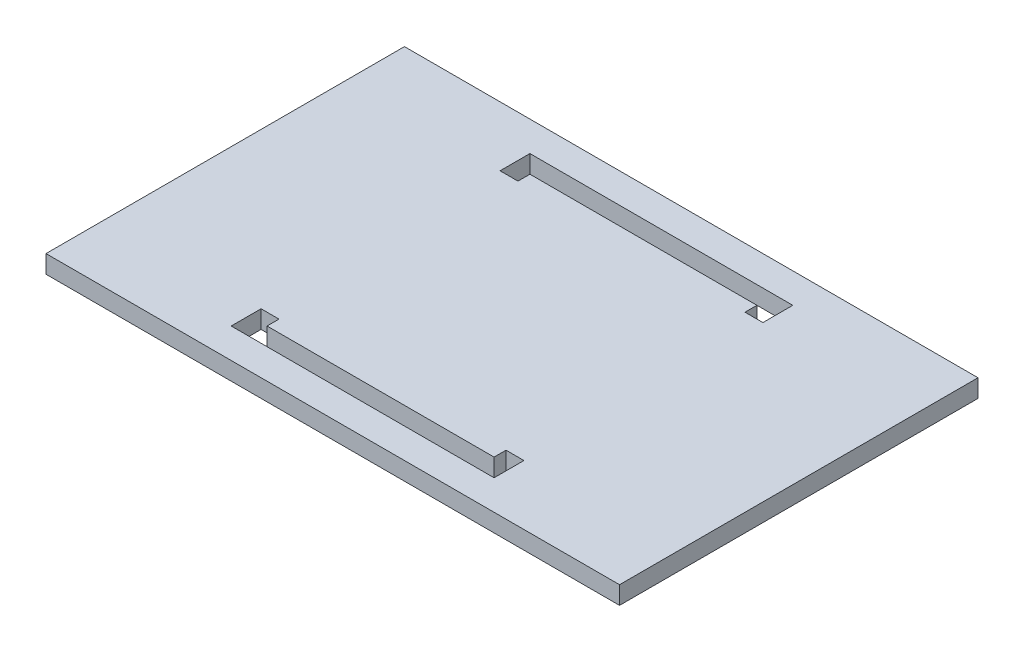
ISO-10303-21;
HEADER;
FILE_DESCRIPTION(('STEP AP214'),'2;1');
FILE_NAME('part.step','',(''),(''),'','','');
FILE_SCHEMA(('AUTOMOTIVE_DESIGN { 1 0 10303 214 1 1 1 1 }'));
ENDSEC;
DATA;
#1=APPLICATION_CONTEXT('core data for automotive mechanical design processes');
#2=APPLICATION_PROTOCOL_DEFINITION('international standard','automotive_design',2000,#1);
#3=PRODUCT_CONTEXT('',#1,'mechanical');
#4=PRODUCT('Part','Part','',(#3));
#5=PRODUCT_RELATED_PRODUCT_CATEGORY('part','',(#4));
#6=PRODUCT_DEFINITION_FORMATION('','',#4);
#7=PRODUCT_DEFINITION_CONTEXT('part definition',#1,'design');
#8=PRODUCT_DEFINITION('design','',#6,#7);
#9=PRODUCT_DEFINITION_SHAPE('','',#8);
#10=(LENGTH_UNIT() NAMED_UNIT(*) SI_UNIT(.MILLI.,.METRE.));
#11=(NAMED_UNIT(*) PLANE_ANGLE_UNIT() SI_UNIT($,.RADIAN.));
#12=(NAMED_UNIT(*) SI_UNIT($,.STERADIAN.) SOLID_ANGLE_UNIT());
#13=UNCERTAINTY_MEASURE_WITH_UNIT(LENGTH_MEASURE(1.E-05),#10,'distance_accuracy_value','');
#14=(GEOMETRIC_REPRESENTATION_CONTEXT(3) GLOBAL_UNCERTAINTY_ASSIGNED_CONTEXT((#13)) GLOBAL_UNIT_ASSIGNED_CONTEXT((#10,
#11,#12)) REPRESENTATION_CONTEXT('',''));
#15=CARTESIAN_POINT('',(0.,0.,0.));
#16=DIRECTION('',(0.,0.,1.));
#17=DIRECTION('',(1.,0.,0.));
#18=AXIS2_PLACEMENT_3D('',#15,#16,#17);
#19=CARTESIAN_POINT('',(0.,3.,25.));
#20=DIRECTION('',(0.,0.,-1.));
#21=DIRECTION('',(-1.,0.,0.));
#22=AXIS2_PLACEMENT_3D('',#19,#20,#21);
#23=PLANE('',#22);
#24=DIRECTION('',(1.,0.,0.));
#25=VECTOR('',#24,1.);
#26=CARTESIAN_POINT('',(0.,0.,25.));
#27=LINE('',#26,#25);
#28=CARTESIAN_POINT('',(-22.,0.,25.));
#29=VERTEX_POINT('',#28);
#30=CARTESIAN_POINT('',(22.,0.,25.));
#31=VERTEX_POINT('',#30);
#32=EDGE_CURVE('E244',#29,#31,#27,.T.);
#33=ORIENTED_EDGE('',*,*,#32,.F.);
#34=DIRECTION('',(0.,-1.,0.));
#35=VECTOR('',#34,1.);
#36=CARTESIAN_POINT('',(-22.,3.,25.));
#37=LINE('',#36,#35);
#38=CARTESIAN_POINT('',(-22.,3.,25.));
#39=VERTEX_POINT('',#38);
#40=EDGE_CURVE('E11',#39,#29,#37,.T.);
#41=ORIENTED_EDGE('',*,*,#40,.F.);
#42=DIRECTION('',(1.,0.,0.));
#43=VECTOR('',#42,1.);
#44=CARTESIAN_POINT('',(0.,3.,25.));
#45=LINE('',#44,#43);
#46=CARTESIAN_POINT('',(22.,3.,25.));
#47=VERTEX_POINT('',#46);
#48=EDGE_CURVE('E342',#39,#47,#45,.T.);
#49=ORIENTED_EDGE('',*,*,#48,.T.);
#50=DIRECTION('',(0.,-1.,0.));
#51=VECTOR('',#50,1.);
#52=CARTESIAN_POINT('',(22.,3.,25.));
#53=LINE('',#52,#51);
#54=EDGE_CURVE('E54',#47,#31,#53,.T.);
#55=ORIENTED_EDGE('',*,*,#54,.T.);
#56=EDGE_LOOP('',(#33,#41,#49,#55));
#57=FACE_BOUND('',#56,.T.);
#58=ADVANCED_FACE('F35',(#57),#23,.T.);
#59=CARTESIAN_POINT('',(-22.,3.,0.));
#60=DIRECTION('',(1.,0.,0.));
#61=DIRECTION('',(0.,0.,-1.));
#62=AXIS2_PLACEMENT_3D('',#59,#60,#61);
#63=PLANE('',#62);
#64=DIRECTION('',(0.,0.,1.));
#65=VECTOR('',#64,1.);
#66=CARTESIAN_POINT('',(-22.,0.,0.));
#67=LINE('',#66,#65);
#68=CARTESIAN_POINT('',(-22.,0.,20.));
#69=VERTEX_POINT('',#68);
#70=EDGE_CURVE('E246',#69,#29,#67,.T.);
#71=ORIENTED_EDGE('',*,*,#70,.F.);
#72=DIRECTION('',(0.,-1.,0.));
#73=VECTOR('',#72,1.);
#74=CARTESIAN_POINT('',(-22.,3.,20.));
#75=LINE('',#74,#73);
#76=CARTESIAN_POINT('',(-22.,3.,20.));
#77=VERTEX_POINT('',#76);
#78=EDGE_CURVE('E45',#77,#69,#75,.T.);
#79=ORIENTED_EDGE('',*,*,#78,.F.);
#80=DIRECTION('',(0.,0.,1.));
#81=VECTOR('',#80,1.);
#82=CARTESIAN_POINT('',(-22.,3.,0.));
#83=LINE('',#82,#81);
#84=EDGE_CURVE('E344',#77,#39,#83,.T.);
#85=ORIENTED_EDGE('',*,*,#84,.T.);
#86=ORIENTED_EDGE('',*,*,#40,.T.);
#87=EDGE_LOOP('',(#71,#79,#85,#86));
#88=FACE_BOUND('',#87,.T.);
#89=ADVANCED_FACE('F370',(#88),#63,.T.);
#90=CARTESIAN_POINT('',(0.,3.,20.));
#91=DIRECTION('',(0.,0.,1.));
#92=DIRECTION('',(1.,0.,0.));
#93=AXIS2_PLACEMENT_3D('',#90,#91,#92);
#94=PLANE('',#93);
#95=DIRECTION('',(-1.,0.,0.));
#96=VECTOR('',#95,1.);
#97=CARTESIAN_POINT('',(0.,0.,20.));
#98=LINE('',#97,#96);
#99=CARTESIAN_POINT('',(-19.,0.,20.));
#100=VERTEX_POINT('',#99);
#101=EDGE_CURVE('E249',#100,#69,#98,.T.);
#102=ORIENTED_EDGE('',*,*,#101,.F.);
#103=DIRECTION('',(0.,-1.,0.));
#104=VECTOR('',#103,1.);
#105=CARTESIAN_POINT('',(-19.,3.,20.));
#106=LINE('',#105,#104);
#107=CARTESIAN_POINT('',(-19.,3.,20.));
#108=VERTEX_POINT('',#107);
#109=EDGE_CURVE('E271',#108,#100,#106,.T.);
#110=ORIENTED_EDGE('',*,*,#109,.F.);
#111=DIRECTION('',(-1.,0.,0.));
#112=VECTOR('',#111,1.);
#113=CARTESIAN_POINT('',(0.,3.,20.));
#114=LINE('',#113,#112);
#115=EDGE_CURVE('E347',#108,#77,#114,.T.);
#116=ORIENTED_EDGE('',*,*,#115,.T.);
#117=ORIENTED_EDGE('',*,*,#78,.T.);
#118=EDGE_LOOP('',(#102,#110,#116,#117));
#119=FACE_BOUND('',#118,.T.);
#120=ADVANCED_FACE('F375',(#119),#94,.T.);
#121=CARTESIAN_POINT('',(-19.,3.,0.));
#122=DIRECTION('',(-1.,0.,0.));
#123=DIRECTION('',(0.,0.,1.));
#124=AXIS2_PLACEMENT_3D('',#121,#122,#123);
#125=PLANE('',#124);
#126=DIRECTION('',(0.,0.,-1.));
#127=VECTOR('',#126,1.);
#128=CARTESIAN_POINT('',(-19.,0.,0.));
#129=LINE('',#128,#127);
#130=CARTESIAN_POINT('',(-19.,0.,22.));
#131=VERTEX_POINT('',#130);
#132=EDGE_CURVE('E252',#131,#100,#129,.T.);
#133=ORIENTED_EDGE('',*,*,#132,.F.);
#134=DIRECTION('',(0.,-1.,0.));
#135=VECTOR('',#134,1.);
#136=CARTESIAN_POINT('',(-19.,3.,22.));
#137=LINE('',#136,#135);
#138=CARTESIAN_POINT('',(-19.,3.,22.));
#139=VERTEX_POINT('',#138);
#140=EDGE_CURVE('E269',#139,#131,#137,.T.);
#141=ORIENTED_EDGE('',*,*,#140,.F.);
#142=DIRECTION('',(0.,0.,-1.));
#143=VECTOR('',#142,1.);
#144=CARTESIAN_POINT('',(-19.,3.,0.));
#145=LINE('',#144,#143);
#146=EDGE_CURVE('E350',#139,#108,#145,.T.);
#147=ORIENTED_EDGE('',*,*,#146,.T.);
#148=ORIENTED_EDGE('',*,*,#109,.T.);
#149=EDGE_LOOP('',(#133,#141,#147,#148));
#150=FACE_BOUND('',#149,.T.);
#151=ADVANCED_FACE('F463',(#150),#125,.T.);
#152=CARTESIAN_POINT('',(0.,3.,22.));
#153=DIRECTION('',(0.,0.,1.));
#154=DIRECTION('',(1.,0.,0.));
#155=AXIS2_PLACEMENT_3D('',#152,#153,#154);
#156=PLANE('',#155);
#157=DIRECTION('',(-1.,0.,0.));
#158=VECTOR('',#157,1.);
#159=CARTESIAN_POINT('',(0.,0.,22.));
#160=LINE('',#159,#158);
#161=CARTESIAN_POINT('',(19.,0.,22.));
#162=VERTEX_POINT('',#161);
#163=EDGE_CURVE('E255',#162,#131,#160,.T.);
#164=ORIENTED_EDGE('',*,*,#163,.F.);
#165=DIRECTION('',(0.,-1.,0.));
#166=VECTOR('',#165,1.);
#167=CARTESIAN_POINT('',(19.,3.,22.));
#168=LINE('',#167,#166);
#169=CARTESIAN_POINT('',(19.,3.,22.));
#170=VERTEX_POINT('',#169);
#171=EDGE_CURVE('E188',#170,#162,#168,.T.);
#172=ORIENTED_EDGE('',*,*,#171,.F.);
#173=DIRECTION('',(-1.,0.,0.));
#174=VECTOR('',#173,1.);
#175=CARTESIAN_POINT('',(0.,3.,22.));
#176=LINE('',#175,#174);
#177=EDGE_CURVE('E199',#170,#139,#176,.T.);
#178=ORIENTED_EDGE('',*,*,#177,.T.);
#179=ORIENTED_EDGE('',*,*,#140,.T.);
#180=EDGE_LOOP('',(#164,#172,#178,#179));
#181=FACE_BOUND('',#180,.T.);
#182=ADVANCED_FACE('F354',(#181),#156,.T.);
#183=CARTESIAN_POINT('',(19.,3.,0.));
#184=DIRECTION('',(1.,0.,0.));
#185=DIRECTION('',(0.,0.,-1.));
#186=AXIS2_PLACEMENT_3D('',#183,#184,#185);
#187=PLANE('',#186);
#188=DIRECTION('',(0.,0.,1.));
#189=VECTOR('',#188,1.);
#190=CARTESIAN_POINT('',(19.,0.,0.));
#191=LINE('',#190,#189);
#192=CARTESIAN_POINT('',(19.,0.,20.));
#193=VERTEX_POINT('',#192);
#194=EDGE_CURVE('E184',#193,#162,#191,.T.);
#195=ORIENTED_EDGE('',*,*,#194,.F.);
#196=DIRECTION('',(0.,-1.,0.));
#197=VECTOR('',#196,1.);
#198=CARTESIAN_POINT('',(19.,3.,20.));
#199=LINE('',#198,#197);
#200=CARTESIAN_POINT('',(19.,3.,20.));
#201=VERTEX_POINT('',#200);
#202=EDGE_CURVE('E179',#201,#193,#199,.T.);
#203=ORIENTED_EDGE('',*,*,#202,.F.);
#204=DIRECTION('',(0.,0.,1.));
#205=VECTOR('',#204,1.);
#206=CARTESIAN_POINT('',(19.,3.,0.));
#207=LINE('',#206,#205);
#208=EDGE_CURVE('E182',#201,#170,#207,.T.);
#209=ORIENTED_EDGE('',*,*,#208,.T.);
#210=ORIENTED_EDGE('',*,*,#171,.T.);
#211=EDGE_LOOP('',(#195,#203,#209,#210));
#212=FACE_BOUND('',#211,.T.);
#213=ADVANCED_FACE('F181',(#212),#187,.T.);
#214=CARTESIAN_POINT('',(0.,3.,20.));
#215=DIRECTION('',(0.,0.,1.));
#216=DIRECTION('',(1.,0.,0.));
#217=AXIS2_PLACEMENT_3D('',#214,#215,#216);
#218=PLANE('',#217);
#219=DIRECTION('',(-1.,0.,0.));
#220=VECTOR('',#219,1.);
#221=CARTESIAN_POINT('',(0.,0.,20.));
#222=LINE('',#221,#220);
#223=CARTESIAN_POINT('',(22.,0.,20.));
#224=VERTEX_POINT('',#223);
#225=EDGE_CURVE('E259',#224,#193,#222,.T.);
#226=ORIENTED_EDGE('',*,*,#225,.F.);
#227=DIRECTION('',(0.,-1.,0.));
#228=VECTOR('',#227,1.);
#229=CARTESIAN_POINT('',(22.,3.,20.));
#230=LINE('',#229,#228);
#231=CARTESIAN_POINT('',(22.,3.,20.));
#232=VERTEX_POINT('',#231);
#233=EDGE_CURVE('E115',#232,#224,#230,.T.);
#234=ORIENTED_EDGE('',*,*,#233,.F.);
#235=DIRECTION('',(-1.,0.,0.));
#236=VECTOR('',#235,1.);
#237=CARTESIAN_POINT('',(0.,3.,20.));
#238=LINE('',#237,#236);
#239=EDGE_CURVE('E196',#232,#201,#238,.T.);
#240=ORIENTED_EDGE('',*,*,#239,.T.);
#241=ORIENTED_EDGE('',*,*,#202,.T.);
#242=EDGE_LOOP('',(#226,#234,#240,#241));
#243=FACE_BOUND('',#242,.T.);
#244=ADVANCED_FACE('F201',(#243),#218,.T.);
#245=CARTESIAN_POINT('',(-22.,3.,0.));
#246=DIRECTION('',(1.,0.,0.));
#247=DIRECTION('',(0.,0.,-1.));
#248=AXIS2_PLACEMENT_3D('',#245,#246,#247);
#249=PLANE('',#248);
#250=DIRECTION('',(0.,0.,1.));
#251=VECTOR('',#250,1.);
#252=CARTESIAN_POINT('',(-22.,0.,0.));
#253=LINE('',#252,#251);
#254=CARTESIAN_POINT('',(-22.,0.,-24.9999999999999));
#255=VERTEX_POINT('',#254);
#256=CARTESIAN_POINT('',(-22.,0.,-20.));
#257=VERTEX_POINT('',#256);
#258=EDGE_CURVE('E220',#255,#257,#253,.T.);
#259=ORIENTED_EDGE('',*,*,#258,.F.);
#260=DIRECTION('',(0.,-1.,0.));
#261=VECTOR('',#260,1.);
#262=CARTESIAN_POINT('',(-22.,3.,-24.9999999999999));
#263=LINE('',#262,#261);
#264=CARTESIAN_POINT('',(-22.,3.,-24.9999999999999));
#265=VERTEX_POINT('',#264);
#266=EDGE_CURVE('E266',#265,#255,#263,.T.);
#267=ORIENTED_EDGE('',*,*,#266,.F.);
#268=DIRECTION('',(0.,0.,1.));
#269=VECTOR('',#268,1.);
#270=CARTESIAN_POINT('',(-22.,3.,0.));
#271=LINE('',#270,#269);
#272=CARTESIAN_POINT('',(-22.,3.,-20.));
#273=VERTEX_POINT('',#272);
#274=EDGE_CURVE('E316',#265,#273,#271,.T.);
#275=ORIENTED_EDGE('',*,*,#274,.T.);
#276=DIRECTION('',(0.,-1.,0.));
#277=VECTOR('',#276,1.);
#278=CARTESIAN_POINT('',(-22.,3.,-20.));
#279=LINE('',#278,#277);
#280=EDGE_CURVE('E274',#273,#257,#279,.T.);
#281=ORIENTED_EDGE('',*,*,#280,.T.);
#282=EDGE_LOOP('',(#259,#267,#275,#281));
#283=FACE_BOUND('',#282,.T.);
#284=ADVANCED_FACE('F406',(#283),#249,.T.);
#285=CARTESIAN_POINT('',(0.,3.,-24.9999999999999));
#286=DIRECTION('',(0.,0.,-1.));
#287=DIRECTION('',(-1.,0.,0.));
#288=AXIS2_PLACEMENT_3D('',#285,#286,#287);
#289=PLANE('',#288);
#290=DIRECTION('',(1.,0.,0.));
#291=VECTOR('',#290,1.);
#292=CARTESIAN_POINT('',(0.,0.,-24.9999999999999));
#293=LINE('',#292,#291);
#294=CARTESIAN_POINT('',(22.,0.,-24.9999999999999));
#295=VERTEX_POINT('',#294);
#296=EDGE_CURVE('E223',#255,#295,#293,.T.);
#297=ORIENTED_EDGE('',*,*,#296,.T.);
#298=DIRECTION('',(0.,-1.,0.));
#299=VECTOR('',#298,1.);
#300=CARTESIAN_POINT('',(22.,3.,-24.9999999999999));
#301=LINE('',#300,#299);
#302=CARTESIAN_POINT('',(22.,3.,-24.9999999999999));
#303=VERTEX_POINT('',#302);
#304=EDGE_CURVE('E286',#303,#295,#301,.T.);
#305=ORIENTED_EDGE('',*,*,#304,.F.);
#306=DIRECTION('',(1.,0.,0.));
#307=VECTOR('',#306,1.);
#308=CARTESIAN_POINT('',(0.,3.,-24.9999999999999));
#309=LINE('',#308,#307);
#310=EDGE_CURVE('E319',#265,#303,#309,.T.);
#311=ORIENTED_EDGE('',*,*,#310,.F.);
#312=ORIENTED_EDGE('',*,*,#266,.T.);
#313=EDGE_LOOP('',(#297,#305,#311,#312));
#314=FACE_BOUND('',#313,.T.);
#315=ADVANCED_FACE('F402',(#314),#289,.F.);
#316=CARTESIAN_POINT('',(22.,3.,0.));
#317=DIRECTION('',(-1.,0.,0.));
#318=DIRECTION('',(0.,0.,1.));
#319=AXIS2_PLACEMENT_3D('',#316,#317,#318);
#320=PLANE('',#319);
#321=DIRECTION('',(0.,0.,-1.));
#322=VECTOR('',#321,1.);
#323=CARTESIAN_POINT('',(22.,0.,0.));
#324=LINE('',#323,#322);
#325=CARTESIAN_POINT('',(22.,0.,-20.));
#326=VERTEX_POINT('',#325);
#327=EDGE_CURVE('E226',#326,#295,#324,.T.);
#328=ORIENTED_EDGE('',*,*,#327,.F.);
#329=DIRECTION('',(0.,-1.,0.));
#330=VECTOR('',#329,1.);
#331=CARTESIAN_POINT('',(22.,3.,-20.));
#332=LINE('',#331,#330);
#333=CARTESIAN_POINT('',(22.,3.,-20.));
#334=VERTEX_POINT('',#333);
#335=EDGE_CURVE('E284',#334,#326,#332,.T.);
#336=ORIENTED_EDGE('',*,*,#335,.F.);
#337=DIRECTION('',(0.,0.,-1.));
#338=VECTOR('',#337,1.);
#339=CARTESIAN_POINT('',(22.,3.,0.));
#340=LINE('',#339,#338);
#341=EDGE_CURVE('E324',#334,#303,#340,.T.);
#342=ORIENTED_EDGE('',*,*,#341,.T.);
#343=ORIENTED_EDGE('',*,*,#304,.T.);
#344=EDGE_LOOP('',(#328,#336,#342,#343));
#345=FACE_BOUND('',#344,.T.);
#346=ADVANCED_FACE('F398',(#345),#320,.T.);
#347=CARTESIAN_POINT('',(0.,3.,-20.));
#348=DIRECTION('',(0.,0.,-1.));
#349=DIRECTION('',(-1.,0.,0.));
#350=AXIS2_PLACEMENT_3D('',#347,#348,#349);
#351=PLANE('',#350);
#352=DIRECTION('',(1.,0.,0.));
#353=VECTOR('',#352,1.);
#354=CARTESIAN_POINT('',(0.,0.,-20.));
#355=LINE('',#354,#353);
#356=CARTESIAN_POINT('',(19.,0.,-20.));
#357=VERTEX_POINT('',#356);
#358=EDGE_CURVE('E229',#357,#326,#355,.T.);
#359=ORIENTED_EDGE('',*,*,#358,.F.);
#360=DIRECTION('',(0.,-1.,0.));
#361=VECTOR('',#360,1.);
#362=CARTESIAN_POINT('',(19.,3.,-20.));
#363=LINE('',#362,#361);
#364=CARTESIAN_POINT('',(19.,3.,-20.));
#365=VERTEX_POINT('',#364);
#366=EDGE_CURVE('E282',#365,#357,#363,.T.);
#367=ORIENTED_EDGE('',*,*,#366,.F.);
#368=DIRECTION('',(1.,0.,0.));
#369=VECTOR('',#368,1.);
#370=CARTESIAN_POINT('',(0.,3.,-20.));
#371=LINE('',#370,#369);
#372=EDGE_CURVE('E327',#365,#334,#371,.T.);
#373=ORIENTED_EDGE('',*,*,#372,.T.);
#374=ORIENTED_EDGE('',*,*,#335,.T.);
#375=EDGE_LOOP('',(#359,#367,#373,#374));
#376=FACE_BOUND('',#375,.T.);
#377=ADVANCED_FACE('F394',(#376),#351,.T.);
#378=CARTESIAN_POINT('',(19.,3.,0.));
#379=DIRECTION('',(1.,0.,0.));
#380=DIRECTION('',(0.,0.,-1.));
#381=AXIS2_PLACEMENT_3D('',#378,#379,#380);
#382=PLANE('',#381);
#383=DIRECTION('',(0.,0.,1.));
#384=VECTOR('',#383,1.);
#385=CARTESIAN_POINT('',(19.,0.,0.));
#386=LINE('',#385,#384);
#387=CARTESIAN_POINT('',(19.,0.,-22.));
#388=VERTEX_POINT('',#387);
#389=EDGE_CURVE('E232',#388,#357,#386,.T.);
#390=ORIENTED_EDGE('',*,*,#389,.F.);
#391=DIRECTION('',(0.,-1.,0.));
#392=VECTOR('',#391,1.);
#393=CARTESIAN_POINT('',(19.,3.,-22.));
#394=LINE('',#393,#392);
#395=CARTESIAN_POINT('',(19.,3.,-22.));
#396=VERTEX_POINT('',#395);
#397=EDGE_CURVE('E280',#396,#388,#394,.T.);
#398=ORIENTED_EDGE('',*,*,#397,.F.);
#399=DIRECTION('',(0.,0.,1.));
#400=VECTOR('',#399,1.);
#401=CARTESIAN_POINT('',(19.,3.,0.));
#402=LINE('',#401,#400);
#403=EDGE_CURVE('E330',#396,#365,#402,.T.);
#404=ORIENTED_EDGE('',*,*,#403,.T.);
#405=ORIENTED_EDGE('',*,*,#366,.T.);
#406=EDGE_LOOP('',(#390,#398,#404,#405));
#407=FACE_BOUND('',#406,.T.);
#408=ADVANCED_FACE('F390',(#407),#382,.T.);
#409=CARTESIAN_POINT('',(0.,3.,-22.));
#410=DIRECTION('',(0.,0.,-1.));
#411=DIRECTION('',(-1.,0.,0.));
#412=AXIS2_PLACEMENT_3D('',#409,#410,#411);
#413=PLANE('',#412);
#414=DIRECTION('',(1.,0.,0.));
#415=VECTOR('',#414,1.);
#416=CARTESIAN_POINT('',(0.,0.,-22.));
#417=LINE('',#416,#415);
#418=CARTESIAN_POINT('',(-19.,0.,-22.));
#419=VERTEX_POINT('',#418);
#420=EDGE_CURVE('E235',#419,#388,#417,.T.);
#421=ORIENTED_EDGE('',*,*,#420,.F.);
#422=DIRECTION('',(0.,-1.,0.));
#423=VECTOR('',#422,1.);
#424=CARTESIAN_POINT('',(-19.,3.,-22.));
#425=LINE('',#424,#423);
#426=CARTESIAN_POINT('',(-19.,3.,-22.));
#427=VERTEX_POINT('',#426);
#428=EDGE_CURVE('E278',#427,#419,#425,.T.);
#429=ORIENTED_EDGE('',*,*,#428,.F.);
#430=DIRECTION('',(1.,0.,0.));
#431=VECTOR('',#430,1.);
#432=CARTESIAN_POINT('',(0.,3.,-22.));
#433=LINE('',#432,#431);
#434=EDGE_CURVE('E333',#427,#396,#433,.T.);
#435=ORIENTED_EDGE('',*,*,#434,.T.);
#436=ORIENTED_EDGE('',*,*,#397,.T.);
#437=EDGE_LOOP('',(#421,#429,#435,#436));
#438=FACE_BOUND('',#437,.T.);
#439=ADVANCED_FACE('F386',(#438),#413,.T.);
#440=CARTESIAN_POINT('',(-19.,3.,0.));
#441=DIRECTION('',(-1.,0.,0.));
#442=DIRECTION('',(0.,0.,1.));
#443=AXIS2_PLACEMENT_3D('',#440,#441,#442);
#444=PLANE('',#443);
#445=DIRECTION('',(0.,0.,-1.));
#446=VECTOR('',#445,1.);
#447=CARTESIAN_POINT('',(-19.,0.,0.));
#448=LINE('',#447,#446);
#449=CARTESIAN_POINT('',(-19.,0.,-20.));
#450=VERTEX_POINT('',#449);
#451=EDGE_CURVE('E238',#450,#419,#448,.T.);
#452=ORIENTED_EDGE('',*,*,#451,.F.);
#453=DIRECTION('',(0.,-1.,0.));
#454=VECTOR('',#453,1.);
#455=CARTESIAN_POINT('',(-19.,3.,-20.));
#456=LINE('',#455,#454);
#457=CARTESIAN_POINT('',(-19.,3.,-20.));
#458=VERTEX_POINT('',#457);
#459=EDGE_CURVE('E276',#458,#450,#456,.T.);
#460=ORIENTED_EDGE('',*,*,#459,.F.);
#461=DIRECTION('',(0.,0.,-1.));
#462=VECTOR('',#461,1.);
#463=CARTESIAN_POINT('',(-19.,3.,0.));
#464=LINE('',#463,#462);
#465=EDGE_CURVE('E336',#458,#427,#464,.T.);
#466=ORIENTED_EDGE('',*,*,#465,.T.);
#467=ORIENTED_EDGE('',*,*,#428,.T.);
#468=EDGE_LOOP('',(#452,#460,#466,#467));
#469=FACE_BOUND('',#468,.T.);
#470=ADVANCED_FACE('F383',(#469),#444,.T.);
#471=CARTESIAN_POINT('',(-48.,3.,0.));
#472=DIRECTION('',(-1.,0.,0.));
#473=DIRECTION('',(0.,0.,1.));
#474=AXIS2_PLACEMENT_3D('',#471,#472,#473);
#475=PLANE('',#474);
#476=DIRECTION('',(0.,0.,-1.));
#477=VECTOR('',#476,1.);
#478=CARTESIAN_POINT('',(-48.,0.,0.));
#479=LINE('',#478,#477);
#480=CARTESIAN_POINT('',(-48.,0.,30.));
#481=VERTEX_POINT('',#480);
#482=CARTESIAN_POINT('',(-48.,0.,-30.));
#483=VERTEX_POINT('',#482);
#484=EDGE_CURVE('E208',#481,#483,#479,.T.);
#485=ORIENTED_EDGE('',*,*,#484,.F.);
#486=DIRECTION('',(0.,-1.,0.));
#487=VECTOR('',#486,1.);
#488=CARTESIAN_POINT('',(-48.,3.,30.));
#489=LINE('',#488,#487);
#490=CARTESIAN_POINT('',(-48.,3.,30.));
#491=VERTEX_POINT('',#490);
#492=EDGE_CURVE('E39',#491,#481,#489,.T.);
#493=ORIENTED_EDGE('',*,*,#492,.F.);
#494=DIRECTION('',(0.,0.,-1.));
#495=VECTOR('',#494,1.);
#496=CARTESIAN_POINT('',(-48.,3.,0.));
#497=LINE('',#496,#495);
#498=CARTESIAN_POINT('',(-48.,3.,-30.));
#499=VERTEX_POINT('',#498);
#500=EDGE_CURVE('E264',#491,#499,#497,.T.);
#501=ORIENTED_EDGE('',*,*,#500,.T.);
#502=DIRECTION('',(0.,-1.,0.));
#503=VECTOR('',#502,1.);
#504=CARTESIAN_POINT('',(-48.,3.,-30.));
#505=LINE('',#504,#503);
#506=EDGE_CURVE('E204',#499,#483,#505,.T.);
#507=ORIENTED_EDGE('',*,*,#506,.T.);
#508=EDGE_LOOP('',(#485,#493,#501,#507));
#509=FACE_BOUND('',#508,.T.);
#510=ADVANCED_FACE('F37',(#509),#475,.T.);
#511=CARTESIAN_POINT('',(0.,3.,30.));
#512=DIRECTION('',(0.,0.,1.));
#513=DIRECTION('',(1.,0.,0.));
#514=AXIS2_PLACEMENT_3D('',#511,#512,#513);
#515=PLANE('',#514);
#516=DIRECTION('',(-1.,0.,0.));
#517=VECTOR('',#516,1.);
#518=CARTESIAN_POINT('',(0.,0.,30.));
#519=LINE('',#518,#517);
#520=CARTESIAN_POINT('',(48.,0.,30.));
#521=VERTEX_POINT('',#520);
#522=EDGE_CURVE('E211',#521,#481,#519,.T.);
#523=ORIENTED_EDGE('',*,*,#522,.F.);
#524=DIRECTION('',(0.,-1.,0.));
#525=VECTOR('',#524,1.);
#526=CARTESIAN_POINT('',(48.,3.,30.));
#527=LINE('',#526,#525);
#528=CARTESIAN_POINT('',(48.,3.,30.));
#529=VERTEX_POINT('',#528);
#530=EDGE_CURVE('E291',#529,#521,#527,.T.);
#531=ORIENTED_EDGE('',*,*,#530,.F.);
#532=DIRECTION('',(-1.,0.,0.));
#533=VECTOR('',#532,1.);
#534=CARTESIAN_POINT('',(0.,3.,30.));
#535=LINE('',#534,#533);
#536=EDGE_CURVE('E300',#529,#491,#535,.T.);
#537=ORIENTED_EDGE('',*,*,#536,.T.);
#538=ORIENTED_EDGE('',*,*,#492,.T.);
#539=EDGE_LOOP('',(#523,#531,#537,#538));
#540=FACE_BOUND('',#539,.T.);
#541=ADVANCED_FACE('F298',(#540),#515,.T.);
#542=CARTESIAN_POINT('',(48.,3.,0.));
#543=DIRECTION('',(1.,0.,0.));
#544=DIRECTION('',(0.,0.,-1.));
#545=AXIS2_PLACEMENT_3D('',#542,#543,#544);
#546=PLANE('',#545);
#547=DIRECTION('',(0.,0.,1.));
#548=VECTOR('',#547,1.);
#549=CARTESIAN_POINT('',(48.,0.,0.));
#550=LINE('',#549,#548);
#551=CARTESIAN_POINT('',(48.,0.,-30.));
#552=VERTEX_POINT('',#551);
#553=EDGE_CURVE('E214',#552,#521,#550,.T.);
#554=ORIENTED_EDGE('',*,*,#553,.F.);
#555=DIRECTION('',(0.,-1.,0.));
#556=VECTOR('',#555,1.);
#557=CARTESIAN_POINT('',(48.,3.,-30.));
#558=LINE('',#557,#556);
#559=CARTESIAN_POINT('',(48.,3.,-30.));
#560=VERTEX_POINT('',#559);
#561=EDGE_CURVE('E290',#560,#552,#558,.T.);
#562=ORIENTED_EDGE('',*,*,#561,.F.);
#563=DIRECTION('',(0.,0.,1.));
#564=VECTOR('',#563,1.);
#565=CARTESIAN_POINT('',(48.,3.,0.));
#566=LINE('',#565,#564);
#567=EDGE_CURVE('E307',#560,#529,#566,.T.);
#568=ORIENTED_EDGE('',*,*,#567,.T.);
#569=ORIENTED_EDGE('',*,*,#530,.T.);
#570=EDGE_LOOP('',(#554,#562,#568,#569));
#571=FACE_BOUND('',#570,.T.);
#572=ADVANCED_FACE('F305',(#571),#546,.T.);
#573=CARTESIAN_POINT('',(0.,3.,-20.));
#574=DIRECTION('',(0.,0.,-1.));
#575=DIRECTION('',(-1.,0.,0.));
#576=AXIS2_PLACEMENT_3D('',#573,#574,#575);
#577=PLANE('',#576);
#578=DIRECTION('',(1.,0.,0.));
#579=VECTOR('',#578,1.);
#580=CARTESIAN_POINT('',(0.,0.,-20.));
#581=LINE('',#580,#579);
#582=EDGE_CURVE('E241',#257,#450,#581,.T.);
#583=ORIENTED_EDGE('',*,*,#582,.F.);
#584=ORIENTED_EDGE('',*,*,#280,.F.);
#585=DIRECTION('',(1.,0.,0.));
#586=VECTOR('',#585,1.);
#587=CARTESIAN_POINT('',(0.,3.,-20.));
#588=LINE('',#587,#586);
#589=EDGE_CURVE('E339',#273,#458,#588,.T.);
#590=ORIENTED_EDGE('',*,*,#589,.T.);
#591=ORIENTED_EDGE('',*,*,#459,.T.);
#592=EDGE_LOOP('',(#583,#584,#590,#591));
#593=FACE_BOUND('',#592,.T.);
#594=ADVANCED_FACE('F365',(#593),#577,.T.);
#595=CARTESIAN_POINT('',(0.,3.,-30.));
#596=DIRECTION('',(0.,0.,-1.));
#597=DIRECTION('',(-1.,0.,0.));
#598=AXIS2_PLACEMENT_3D('',#595,#596,#597);
#599=PLANE('',#598);
#600=DIRECTION('',(1.,0.,0.));
#601=VECTOR('',#600,1.);
#602=CARTESIAN_POINT('',(0.,0.,-30.));
#603=LINE('',#602,#601);
#604=EDGE_CURVE('E217',#483,#552,#603,.T.);
#605=ORIENTED_EDGE('',*,*,#604,.F.);
#606=ORIENTED_EDGE('',*,*,#506,.F.);
#607=DIRECTION('',(1.,0.,0.));
#608=VECTOR('',#607,1.);
#609=CARTESIAN_POINT('',(0.,3.,-30.));
#610=LINE('',#609,#608);
#611=EDGE_CURVE('E313',#499,#560,#610,.T.);
#612=ORIENTED_EDGE('',*,*,#611,.T.);
#613=ORIENTED_EDGE('',*,*,#561,.T.);
#614=EDGE_LOOP('',(#605,#606,#612,#613));
#615=FACE_BOUND('',#614,.T.);
#616=ADVANCED_FACE('F315',(#615),#599,.T.);
#617=CARTESIAN_POINT('',(22.,3.,0.));
#618=DIRECTION('',(-1.,0.,0.));
#619=DIRECTION('',(0.,0.,1.));
#620=AXIS2_PLACEMENT_3D('',#617,#618,#619);
#621=PLANE('',#620);
#622=DIRECTION('',(0.,0.,-1.));
#623=VECTOR('',#622,1.);
#624=CARTESIAN_POINT('',(22.,0.,0.));
#625=LINE('',#624,#623);
#626=EDGE_CURVE('E261',#31,#224,#625,.T.);
#627=ORIENTED_EDGE('',*,*,#626,.F.);
#628=ORIENTED_EDGE('',*,*,#54,.F.);
#629=DIRECTION('',(0.,0.,-1.));
#630=VECTOR('',#629,1.);
#631=CARTESIAN_POINT('',(22.,3.,0.));
#632=LINE('',#631,#630);
#633=EDGE_CURVE('E202',#47,#232,#632,.T.);
#634=ORIENTED_EDGE('',*,*,#633,.T.);
#635=ORIENTED_EDGE('',*,*,#233,.T.);
#636=EDGE_LOOP('',(#627,#628,#634,#635));
#637=FACE_BOUND('',#636,.T.);
#638=ADVANCED_FACE('F357',(#637),#621,.T.);
#639=CARTESIAN_POINT('',(0.,3.,0.));
#640=DIRECTION('',(0.,1.,0.));
#641=DIRECTION('',(0.,0.,1.));
#642=AXIS2_PLACEMENT_3D('',#639,#640,#641);
#643=PLANE('',#642);
#644=ORIENTED_EDGE('',*,*,#500,.F.);
#645=ORIENTED_EDGE('',*,*,#536,.F.);
#646=ORIENTED_EDGE('',*,*,#567,.F.);
#647=ORIENTED_EDGE('',*,*,#611,.F.);
#648=EDGE_LOOP('',(#644,#645,#646,#647));
#649=FACE_BOUND('',#648,.T.);
#650=ORIENTED_EDGE('',*,*,#274,.F.);
#651=ORIENTED_EDGE('',*,*,#310,.T.);
#652=ORIENTED_EDGE('',*,*,#341,.F.);
#653=ORIENTED_EDGE('',*,*,#372,.F.);
#654=ORIENTED_EDGE('',*,*,#403,.F.);
#655=ORIENTED_EDGE('',*,*,#434,.F.);
#656=ORIENTED_EDGE('',*,*,#465,.F.);
#657=ORIENTED_EDGE('',*,*,#589,.F.);
#658=EDGE_LOOP('',(#650,#651,#652,#653,#654,#655,#656,#657));
#659=FACE_BOUND('',#658,.T.);
#660=ORIENTED_EDGE('',*,*,#48,.F.);
#661=ORIENTED_EDGE('',*,*,#84,.F.);
#662=ORIENTED_EDGE('',*,*,#115,.F.);
#663=ORIENTED_EDGE('',*,*,#146,.F.);
#664=ORIENTED_EDGE('',*,*,#177,.F.);
#665=ORIENTED_EDGE('',*,*,#208,.F.);
#666=ORIENTED_EDGE('',*,*,#239,.F.);
#667=ORIENTED_EDGE('',*,*,#633,.F.);
#668=EDGE_LOOP('',(#660,#661,#662,#663,#664,#665,#666,#667));
#669=FACE_BOUND('',#668,.T.);
#670=ADVANCED_FACE('F194',(#649,#659,#669),#643,.T.);
#671=CARTESIAN_POINT('',(0.,0.,0.));
#672=DIRECTION('',(0.,1.,0.));
#673=DIRECTION('',(0.,0.,1.));
#674=AXIS2_PLACEMENT_3D('',#671,#672,#673);
#675=PLANE('',#674);
#676=ORIENTED_EDGE('',*,*,#484,.T.);
#677=ORIENTED_EDGE('',*,*,#604,.T.);
#678=ORIENTED_EDGE('',*,*,#553,.T.);
#679=ORIENTED_EDGE('',*,*,#522,.T.);
#680=EDGE_LOOP('',(#676,#677,#678,#679));
#681=FACE_BOUND('',#680,.T.);
#682=ORIENTED_EDGE('',*,*,#258,.T.);
#683=ORIENTED_EDGE('',*,*,#582,.T.);
#684=ORIENTED_EDGE('',*,*,#451,.T.);
#685=ORIENTED_EDGE('',*,*,#420,.T.);
#686=ORIENTED_EDGE('',*,*,#389,.T.);
#687=ORIENTED_EDGE('',*,*,#358,.T.);
#688=ORIENTED_EDGE('',*,*,#327,.T.);
#689=ORIENTED_EDGE('',*,*,#296,.F.);
#690=EDGE_LOOP('',(#682,#683,#684,#685,#686,#687,#688,#689));
#691=FACE_BOUND('',#690,.T.);
#692=ORIENTED_EDGE('',*,*,#32,.T.);
#693=ORIENTED_EDGE('',*,*,#626,.T.);
#694=ORIENTED_EDGE('',*,*,#225,.T.);
#695=ORIENTED_EDGE('',*,*,#194,.T.);
#696=ORIENTED_EDGE('',*,*,#163,.T.);
#697=ORIENTED_EDGE('',*,*,#132,.T.);
#698=ORIENTED_EDGE('',*,*,#101,.T.);
#699=ORIENTED_EDGE('',*,*,#70,.T.);
#700=EDGE_LOOP('',(#692,#693,#694,#695,#696,#697,#698,#699));
#701=FACE_BOUND('',#700,.T.);
#702=ADVANCED_FACE('F303',(#681,#691,#701),#675,.F.);
#703=CLOSED_SHELL('',(#58,#89,#120,#151,#182,#213,#244,#284,#315,#346,#377,#408,#439,#470,#510,
#541,#572,#594,#616,#638,#670,#702));
#704=MANIFOLD_SOLID_BREP('B2',#703);
#705=ADVANCED_BREP_SHAPE_REPRESENTATION('',(#18,#704),#14);
#706=SHAPE_DEFINITION_REPRESENTATION(#9,#705);
ENDSEC;
END-ISO-10303-21;
